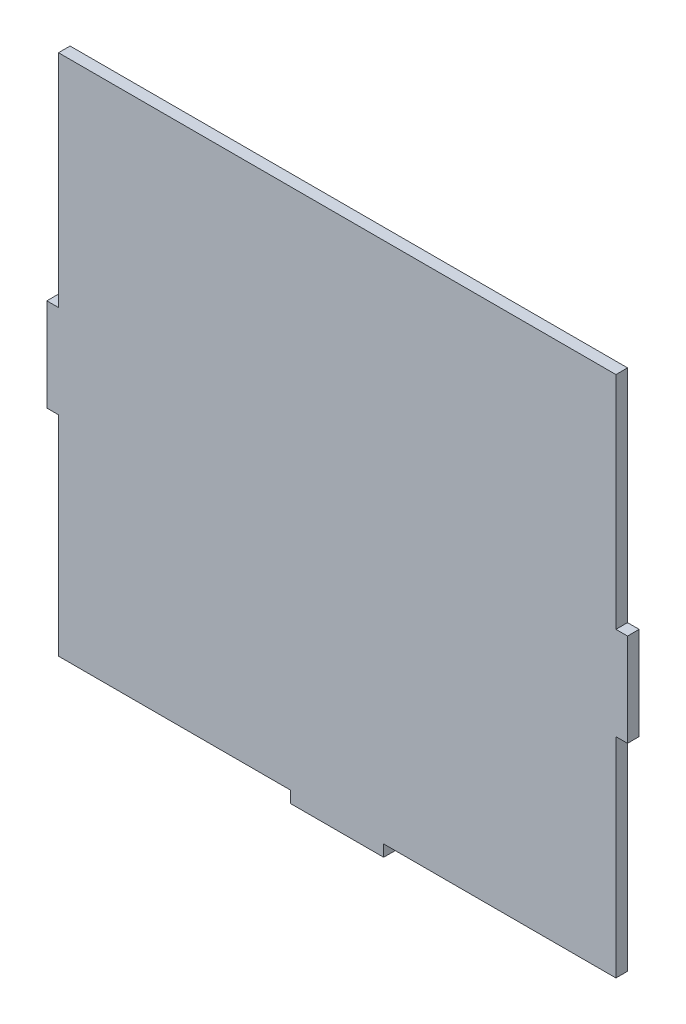
ISO-10303-21;
HEADER;
FILE_DESCRIPTION(('STEP AP214'),'2;1');
FILE_NAME('part.step','',(''),(''),'','','');
FILE_SCHEMA(('AUTOMOTIVE_DESIGN { 1 0 10303 214 1 1 1 1 }'));
ENDSEC;
DATA;
#1=APPLICATION_CONTEXT('core data for automotive mechanical design processes');
#2=APPLICATION_PROTOCOL_DEFINITION('international standard','automotive_design',2000,#1);
#3=PRODUCT_CONTEXT('',#1,'mechanical');
#4=PRODUCT('Part','Part','',(#3));
#5=PRODUCT_RELATED_PRODUCT_CATEGORY('part','',(#4));
#6=PRODUCT_DEFINITION_FORMATION('','',#4);
#7=PRODUCT_DEFINITION_CONTEXT('part definition',#1,'design');
#8=PRODUCT_DEFINITION('design','',#6,#7);
#9=PRODUCT_DEFINITION_SHAPE('','',#8);
#10=(LENGTH_UNIT() NAMED_UNIT(*) SI_UNIT(.MILLI.,.METRE.));
#11=(NAMED_UNIT(*) PLANE_ANGLE_UNIT() SI_UNIT($,.RADIAN.));
#12=(NAMED_UNIT(*) SI_UNIT($,.STERADIAN.) SOLID_ANGLE_UNIT());
#13=UNCERTAINTY_MEASURE_WITH_UNIT(LENGTH_MEASURE(1.E-05),#10,'distance_accuracy_value','');
#14=(GEOMETRIC_REPRESENTATION_CONTEXT(3) GLOBAL_UNCERTAINTY_ASSIGNED_CONTEXT((#13)) GLOBAL_UNIT_ASSIGNED_CONTEXT((#10,
#11,#12)) REPRESENTATION_CONTEXT('',''));
#15=CARTESIAN_POINT('',(0.,0.,0.));
#16=DIRECTION('',(0.,0.,1.));
#17=DIRECTION('',(1.,0.,0.));
#18=AXIS2_PLACEMENT_3D('',#15,#16,#17);
#19=CARTESIAN_POINT('',(5.,-316.519772215718,5.));
#20=DIRECTION('',(0.,1.,0.));
#21=DIRECTION('',(0.,0.,1.));
#22=AXIS2_PLACEMENT_3D('',#19,#20,#21);
#23=PLANE('',#22);
#24=DIRECTION('',(1.,0.,0.));
#25=VECTOR('',#24,1.);
#26=CARTESIAN_POINT('',(5.,-316.519772215718,0.));
#27=LINE('',#26,#25);
#28=CARTESIAN_POINT('',(5.,-316.519772215718,0.));
#29=VERTEX_POINT('',#28);
#30=CARTESIAN_POINT('',(105.,-316.519772215718,0.));
#31=VERTEX_POINT('',#30);
#32=EDGE_CURVE('E178',#29,#31,#27,.T.);
#33=ORIENTED_EDGE('',*,*,#32,.T.);
#34=DIRECTION('',(0.,0.,-1.));
#35=VECTOR('',#34,1.);
#36=CARTESIAN_POINT('',(105.,-316.519772215718,5.));
#37=LINE('',#36,#35);
#38=CARTESIAN_POINT('',(105.,-316.519772215718,5.));
#39=VERTEX_POINT('',#38);
#40=EDGE_CURVE('E11',#39,#31,#37,.T.);
#41=ORIENTED_EDGE('',*,*,#40,.F.);
#42=DIRECTION('',(1.,0.,0.));
#43=VECTOR('',#42,1.);
#44=CARTESIAN_POINT('',(5.,-316.519772215718,5.));
#45=LINE('',#44,#43);
#46=CARTESIAN_POINT('',(5.,-316.519772215718,5.));
#47=VERTEX_POINT('',#46);
#48=EDGE_CURVE('E208',#47,#39,#45,.T.);
#49=ORIENTED_EDGE('',*,*,#48,.F.);
#50=DIRECTION('',(0.,0.,-1.));
#51=VECTOR('',#50,1.);
#52=CARTESIAN_POINT('',(5.,-316.519772215718,5.));
#53=LINE('',#52,#51);
#54=EDGE_CURVE('E174',#47,#29,#53,.T.);
#55=ORIENTED_EDGE('',*,*,#54,.T.);
#56=EDGE_LOOP('',(#33,#41,#49,#55));
#57=FACE_BOUND('',#56,.T.);
#58=ADVANCED_FACE('F34',(#57),#23,.F.);
#59=CARTESIAN_POINT('',(105.,-316.519772215718,5.));
#60=DIRECTION('',(1.,0.,0.));
#61=DIRECTION('',(0.,0.,-1.));
#62=AXIS2_PLACEMENT_3D('',#59,#60,#61);
#63=PLANE('',#62);
#64=DIRECTION('',(0.,-1.,0.));
#65=VECTOR('',#64,1.);
#66=CARTESIAN_POINT('',(105.,-316.519772215718,0.));
#67=LINE('',#66,#65);
#68=CARTESIAN_POINT('',(105.,-321.519772215718,0.));
#69=VERTEX_POINT('',#68);
#70=EDGE_CURVE('E181',#31,#69,#67,.T.);
#71=ORIENTED_EDGE('',*,*,#70,.T.);
#72=DIRECTION('',(0.,0.,-1.));
#73=VECTOR('',#72,1.);
#74=CARTESIAN_POINT('',(105.,-321.519772215718,5.));
#75=LINE('',#74,#73);
#76=CARTESIAN_POINT('',(105.,-321.519772215718,5.));
#77=VERTEX_POINT('',#76);
#78=EDGE_CURVE('E42',#77,#69,#75,.T.);
#79=ORIENTED_EDGE('',*,*,#78,.F.);
#80=DIRECTION('',(0.,-1.,0.));
#81=VECTOR('',#80,1.);
#82=CARTESIAN_POINT('',(105.,-316.519772215718,5.));
#83=LINE('',#82,#81);
#84=EDGE_CURVE('E117',#39,#77,#83,.T.);
#85=ORIENTED_EDGE('',*,*,#84,.F.);
#86=ORIENTED_EDGE('',*,*,#40,.T.);
#87=EDGE_LOOP('',(#71,#79,#85,#86));
#88=FACE_BOUND('',#87,.T.);
#89=ADVANCED_FACE('F306',(#88),#63,.F.);
#90=CARTESIAN_POINT('',(105.,-321.519772215718,5.));
#91=DIRECTION('',(0.,1.,0.));
#92=DIRECTION('',(0.,0.,1.));
#93=AXIS2_PLACEMENT_3D('',#90,#91,#92);
#94=PLANE('',#93);
#95=DIRECTION('',(1.,0.,0.));
#96=VECTOR('',#95,1.);
#97=CARTESIAN_POINT('',(105.,-321.519772215718,0.));
#98=LINE('',#97,#96);
#99=CARTESIAN_POINT('',(145.,-321.519772215718,0.));
#100=VERTEX_POINT('',#99);
#101=EDGE_CURVE('E183',#69,#100,#98,.T.);
#102=ORIENTED_EDGE('',*,*,#101,.T.);
#103=DIRECTION('',(0.,0.,-1.));
#104=VECTOR('',#103,1.);
#105=CARTESIAN_POINT('',(145.,-321.519772215718,5.));
#106=LINE('',#105,#104);
#107=CARTESIAN_POINT('',(145.,-321.519772215718,5.));
#108=VERTEX_POINT('',#107);
#109=EDGE_CURVE('E239',#108,#100,#106,.T.);
#110=ORIENTED_EDGE('',*,*,#109,.F.);
#111=DIRECTION('',(1.,0.,0.));
#112=VECTOR('',#111,1.);
#113=CARTESIAN_POINT('',(105.,-321.519772215718,5.));
#114=LINE('',#113,#112);
#115=EDGE_CURVE('E247',#77,#108,#114,.T.);
#116=ORIENTED_EDGE('',*,*,#115,.F.);
#117=ORIENTED_EDGE('',*,*,#78,.T.);
#118=EDGE_LOOP('',(#102,#110,#116,#117));
#119=FACE_BOUND('',#118,.T.);
#120=ADVANCED_FACE('F245',(#119),#94,.F.);
#121=CARTESIAN_POINT('',(145.,-316.519772215718,5.));
#122=DIRECTION('',(-1.,0.,0.));
#123=DIRECTION('',(0.,0.,1.));
#124=AXIS2_PLACEMENT_3D('',#121,#122,#123);
#125=PLANE('',#124);
#126=DIRECTION('',(0.,1.,0.));
#127=VECTOR('',#126,1.);
#128=CARTESIAN_POINT('',(145.,-316.519772215718,0.));
#129=LINE('',#128,#127);
#130=CARTESIAN_POINT('',(145.,-316.519772215718,0.));
#131=VERTEX_POINT('',#130);
#132=EDGE_CURVE('E185',#100,#131,#129,.T.);
#133=ORIENTED_EDGE('',*,*,#132,.T.);
#134=DIRECTION('',(0.,0.,-1.));
#135=VECTOR('',#134,1.);
#136=CARTESIAN_POINT('',(145.,-316.519772215718,5.));
#137=LINE('',#136,#135);
#138=CARTESIAN_POINT('',(145.,-316.519772215718,5.));
#139=VERTEX_POINT('',#138);
#140=EDGE_CURVE('E236',#139,#131,#137,.T.);
#141=ORIENTED_EDGE('',*,*,#140,.F.);
#142=DIRECTION('',(0.,1.,0.));
#143=VECTOR('',#142,1.);
#144=CARTESIAN_POINT('',(145.,-316.519772215718,5.));
#145=LINE('',#144,#143);
#146=EDGE_CURVE('E265',#108,#139,#145,.T.);
#147=ORIENTED_EDGE('',*,*,#146,.F.);
#148=ORIENTED_EDGE('',*,*,#109,.T.);
#149=EDGE_LOOP('',(#133,#141,#147,#148));
#150=FACE_BOUND('',#149,.T.);
#151=ADVANCED_FACE('F256',(#150),#125,.F.);
#152=CARTESIAN_POINT('',(145.,-316.519772215718,5.));
#153=DIRECTION('',(0.,1.,0.));
#154=DIRECTION('',(0.,0.,1.));
#155=AXIS2_PLACEMENT_3D('',#152,#153,#154);
#156=PLANE('',#155);
#157=DIRECTION('',(1.,0.,0.));
#158=VECTOR('',#157,1.);
#159=CARTESIAN_POINT('',(145.,-316.519772215718,0.));
#160=LINE('',#159,#158);
#161=CARTESIAN_POINT('',(245.,-316.519772215718,0.));
#162=VERTEX_POINT('',#161);
#163=EDGE_CURVE('E187',#131,#162,#160,.T.);
#164=ORIENTED_EDGE('',*,*,#163,.T.);
#165=DIRECTION('',(0.,0.,-1.));
#166=VECTOR('',#165,1.);
#167=CARTESIAN_POINT('',(245.,-316.519772215718,5.));
#168=LINE('',#167,#166);
#169=CARTESIAN_POINT('',(245.,-316.519772215718,5.));
#170=VERTEX_POINT('',#169);
#171=EDGE_CURVE('E233',#170,#162,#168,.T.);
#172=ORIENTED_EDGE('',*,*,#171,.F.);
#173=DIRECTION('',(1.,0.,0.));
#174=VECTOR('',#173,1.);
#175=CARTESIAN_POINT('',(145.,-316.519772215718,5.));
#176=LINE('',#175,#174);
#177=EDGE_CURVE('E262',#139,#170,#176,.T.);
#178=ORIENTED_EDGE('',*,*,#177,.F.);
#179=ORIENTED_EDGE('',*,*,#140,.T.);
#180=EDGE_LOOP('',(#164,#172,#178,#179));
#181=FACE_BOUND('',#180,.T.);
#182=ADVANCED_FACE('F260',(#181),#156,.F.);
#183=CARTESIAN_POINT('',(245.,-226.519772215718,5.));
#184=DIRECTION('',(-1.,0.,0.));
#185=DIRECTION('',(0.,0.,1.));
#186=AXIS2_PLACEMENT_3D('',#183,#184,#185);
#187=PLANE('',#186);
#188=DIRECTION('',(0.,1.,0.));
#189=VECTOR('',#188,1.);
#190=CARTESIAN_POINT('',(245.,-226.519772215718,0.));
#191=LINE('',#190,#189);
#192=CARTESIAN_POINT('',(245.,-226.519772215718,0.));
#193=VERTEX_POINT('',#192);
#194=EDGE_CURVE('E189',#162,#193,#191,.T.);
#195=ORIENTED_EDGE('',*,*,#194,.T.);
#196=DIRECTION('',(0.,0.,-1.));
#197=VECTOR('',#196,1.);
#198=CARTESIAN_POINT('',(245.,-226.519772215718,5.));
#199=LINE('',#198,#197);
#200=CARTESIAN_POINT('',(245.,-226.519772215718,5.));
#201=VERTEX_POINT('',#200);
#202=EDGE_CURVE('E230',#201,#193,#199,.T.);
#203=ORIENTED_EDGE('',*,*,#202,.F.);
#204=DIRECTION('',(0.,1.,0.));
#205=VECTOR('',#204,1.);
#206=CARTESIAN_POINT('',(245.,-226.519772215718,5.));
#207=LINE('',#206,#205);
#208=EDGE_CURVE('E264',#170,#201,#207,.T.);
#209=ORIENTED_EDGE('',*,*,#208,.F.);
#210=ORIENTED_EDGE('',*,*,#171,.T.);
#211=EDGE_LOOP('',(#195,#203,#209,#210));
#212=FACE_BOUND('',#211,.T.);
#213=ADVANCED_FACE('F319',(#212),#187,.F.);
#214=CARTESIAN_POINT('',(250.,-226.519772215718,5.));
#215=DIRECTION('',(0.,1.,0.));
#216=DIRECTION('',(0.,0.,1.));
#217=AXIS2_PLACEMENT_3D('',#214,#215,#216);
#218=PLANE('',#217);
#219=DIRECTION('',(1.,0.,0.));
#220=VECTOR('',#219,1.);
#221=CARTESIAN_POINT('',(250.,-226.519772215718,0.));
#222=LINE('',#221,#220);
#223=CARTESIAN_POINT('',(250.,-226.519772215718,0.));
#224=VERTEX_POINT('',#223);
#225=EDGE_CURVE('E191',#193,#224,#222,.T.);
#226=ORIENTED_EDGE('',*,*,#225,.T.);
#227=DIRECTION('',(0.,0.,-1.));
#228=VECTOR('',#227,1.);
#229=CARTESIAN_POINT('',(250.,-226.519772215718,5.));
#230=LINE('',#229,#228);
#231=CARTESIAN_POINT('',(250.,-226.519772215718,5.));
#232=VERTEX_POINT('',#231);
#233=EDGE_CURVE('E227',#232,#224,#230,.T.);
#234=ORIENTED_EDGE('',*,*,#233,.F.);
#235=DIRECTION('',(1.,0.,0.));
#236=VECTOR('',#235,1.);
#237=CARTESIAN_POINT('',(250.,-226.519772215718,5.));
#238=LINE('',#237,#236);
#239=EDGE_CURVE('E267',#201,#232,#238,.T.);
#240=ORIENTED_EDGE('',*,*,#239,.F.);
#241=ORIENTED_EDGE('',*,*,#202,.T.);
#242=EDGE_LOOP('',(#226,#234,#240,#241));
#243=FACE_BOUND('',#242,.T.);
#244=ADVANCED_FACE('F322',(#243),#218,.F.);
#245=CARTESIAN_POINT('',(250.,-186.519772215718,5.));
#246=DIRECTION('',(-1.,0.,0.));
#247=DIRECTION('',(0.,0.,1.));
#248=AXIS2_PLACEMENT_3D('',#245,#246,#247);
#249=PLANE('',#248);
#250=DIRECTION('',(0.,1.,0.));
#251=VECTOR('',#250,1.);
#252=CARTESIAN_POINT('',(250.,-186.519772215718,0.));
#253=LINE('',#252,#251);
#254=CARTESIAN_POINT('',(250.,-186.519772215718,0.));
#255=VERTEX_POINT('',#254);
#256=EDGE_CURVE('E193',#224,#255,#253,.T.);
#257=ORIENTED_EDGE('',*,*,#256,.T.);
#258=DIRECTION('',(0.,0.,-1.));
#259=VECTOR('',#258,1.);
#260=CARTESIAN_POINT('',(250.,-186.519772215718,5.));
#261=LINE('',#260,#259);
#262=CARTESIAN_POINT('',(250.,-186.519772215718,5.));
#263=VERTEX_POINT('',#262);
#264=EDGE_CURVE('E224',#263,#255,#261,.T.);
#265=ORIENTED_EDGE('',*,*,#264,.F.);
#266=DIRECTION('',(0.,1.,0.));
#267=VECTOR('',#266,1.);
#268=CARTESIAN_POINT('',(250.,-186.519772215718,5.));
#269=LINE('',#268,#267);
#270=EDGE_CURVE('E273',#232,#263,#269,.T.);
#271=ORIENTED_EDGE('',*,*,#270,.F.);
#272=ORIENTED_EDGE('',*,*,#233,.T.);
#273=EDGE_LOOP('',(#257,#265,#271,#272));
#274=FACE_BOUND('',#273,.T.);
#275=ADVANCED_FACE('F326',(#274),#249,.F.);
#276=CARTESIAN_POINT('',(245.,-186.519772215718,5.));
#277=DIRECTION('',(0.,-1.,0.));
#278=DIRECTION('',(0.,0.,-1.));
#279=AXIS2_PLACEMENT_3D('',#276,#277,#278);
#280=PLANE('',#279);
#281=DIRECTION('',(-1.,0.,0.));
#282=VECTOR('',#281,1.);
#283=CARTESIAN_POINT('',(245.,-186.519772215718,0.));
#284=LINE('',#283,#282);
#285=CARTESIAN_POINT('',(245.,-186.519772215718,0.));
#286=VERTEX_POINT('',#285);
#287=EDGE_CURVE('E195',#255,#286,#284,.T.);
#288=ORIENTED_EDGE('',*,*,#287,.T.);
#289=DIRECTION('',(0.,0.,-1.));
#290=VECTOR('',#289,1.);
#291=CARTESIAN_POINT('',(245.,-186.519772215718,5.));
#292=LINE('',#291,#290);
#293=CARTESIAN_POINT('',(245.,-186.519772215718,5.));
#294=VERTEX_POINT('',#293);
#295=EDGE_CURVE('E221',#294,#286,#292,.T.);
#296=ORIENTED_EDGE('',*,*,#295,.F.);
#297=DIRECTION('',(-1.,0.,0.));
#298=VECTOR('',#297,1.);
#299=CARTESIAN_POINT('',(245.,-186.519772215718,5.));
#300=LINE('',#299,#298);
#301=EDGE_CURVE('E275',#263,#294,#300,.T.);
#302=ORIENTED_EDGE('',*,*,#301,.F.);
#303=ORIENTED_EDGE('',*,*,#264,.T.);
#304=EDGE_LOOP('',(#288,#296,#302,#303));
#305=FACE_BOUND('',#304,.T.);
#306=ADVANCED_FACE('F330',(#305),#280,.F.);
#307=CARTESIAN_POINT('',(245.,-91.5197722157181,5.));
#308=DIRECTION('',(-1.,0.,0.));
#309=DIRECTION('',(0.,0.,1.));
#310=AXIS2_PLACEMENT_3D('',#307,#308,#309);
#311=PLANE('',#310);
#312=DIRECTION('',(0.,1.,0.));
#313=VECTOR('',#312,1.);
#314=CARTESIAN_POINT('',(245.,-91.5197722157181,0.));
#315=LINE('',#314,#313);
#316=CARTESIAN_POINT('',(245.,-91.5197722157181,0.));
#317=VERTEX_POINT('',#316);
#318=EDGE_CURVE('E197',#286,#317,#315,.T.);
#319=ORIENTED_EDGE('',*,*,#318,.T.);
#320=DIRECTION('',(0.,0.,-1.));
#321=VECTOR('',#320,1.);
#322=CARTESIAN_POINT('',(245.,-91.5197722157181,5.));
#323=LINE('',#322,#321);
#324=CARTESIAN_POINT('',(245.,-91.5197722157181,5.));
#325=VERTEX_POINT('',#324);
#326=EDGE_CURVE('E218',#325,#317,#323,.T.);
#327=ORIENTED_EDGE('',*,*,#326,.F.);
#328=DIRECTION('',(0.,1.,0.));
#329=VECTOR('',#328,1.);
#330=CARTESIAN_POINT('',(245.,-91.5197722157181,5.));
#331=LINE('',#330,#329);
#332=EDGE_CURVE('E277',#294,#325,#331,.T.);
#333=ORIENTED_EDGE('',*,*,#332,.F.);
#334=ORIENTED_EDGE('',*,*,#295,.T.);
#335=EDGE_LOOP('',(#319,#327,#333,#334));
#336=FACE_BOUND('',#335,.T.);
#337=ADVANCED_FACE('F334',(#336),#311,.F.);
#338=CARTESIAN_POINT('',(5.,-91.5197722157181,5.));
#339=DIRECTION('',(0.,-1.,0.));
#340=DIRECTION('',(0.,0.,-1.));
#341=AXIS2_PLACEMENT_3D('',#338,#339,#340);
#342=PLANE('',#341);
#343=DIRECTION('',(-1.,0.,0.));
#344=VECTOR('',#343,1.);
#345=CARTESIAN_POINT('',(5.,-91.5197722157181,0.));
#346=LINE('',#345,#344);
#347=CARTESIAN_POINT('',(5.,-91.5197722157181,0.));
#348=VERTEX_POINT('',#347);
#349=EDGE_CURVE('E199',#317,#348,#346,.T.);
#350=ORIENTED_EDGE('',*,*,#349,.T.);
#351=DIRECTION('',(0.,0.,-1.));
#352=VECTOR('',#351,1.);
#353=CARTESIAN_POINT('',(5.,-91.5197722157181,5.));
#354=LINE('',#353,#352);
#355=CARTESIAN_POINT('',(5.,-91.5197722157181,5.));
#356=VERTEX_POINT('',#355);
#357=EDGE_CURVE('E215',#356,#348,#354,.T.);
#358=ORIENTED_EDGE('',*,*,#357,.F.);
#359=DIRECTION('',(-1.,0.,0.));
#360=VECTOR('',#359,1.);
#361=CARTESIAN_POINT('',(5.,-91.5197722157181,5.));
#362=LINE('',#361,#360);
#363=EDGE_CURVE('E279',#325,#356,#362,.T.);
#364=ORIENTED_EDGE('',*,*,#363,.F.);
#365=ORIENTED_EDGE('',*,*,#326,.T.);
#366=EDGE_LOOP('',(#350,#358,#364,#365));
#367=FACE_BOUND('',#366,.T.);
#368=ADVANCED_FACE('F338',(#367),#342,.F.);
#369=CARTESIAN_POINT('',(5.,-91.5197722157181,5.));
#370=DIRECTION('',(1.,0.,0.));
#371=DIRECTION('',(0.,0.,-1.));
#372=AXIS2_PLACEMENT_3D('',#369,#370,#371);
#373=PLANE('',#372);
#374=DIRECTION('',(0.,-1.,0.));
#375=VECTOR('',#374,1.);
#376=CARTESIAN_POINT('',(5.,-91.5197722157181,0.));
#377=LINE('',#376,#375);
#378=CARTESIAN_POINT('',(5.,-186.519772215718,0.));
#379=VERTEX_POINT('',#378);
#380=EDGE_CURVE('E201',#348,#379,#377,.T.);
#381=ORIENTED_EDGE('',*,*,#380,.T.);
#382=DIRECTION('',(0.,0.,-1.));
#383=VECTOR('',#382,1.);
#384=CARTESIAN_POINT('',(5.,-186.519772215718,5.));
#385=LINE('',#384,#383);
#386=CARTESIAN_POINT('',(5.,-186.519772215718,5.));
#387=VERTEX_POINT('',#386);
#388=EDGE_CURVE('E212',#387,#379,#385,.T.);
#389=ORIENTED_EDGE('',*,*,#388,.F.);
#390=DIRECTION('',(0.,-1.,0.));
#391=VECTOR('',#390,1.);
#392=CARTESIAN_POINT('',(5.,-91.5197722157181,5.));
#393=LINE('',#392,#391);
#394=EDGE_CURVE('E281',#356,#387,#393,.T.);
#395=ORIENTED_EDGE('',*,*,#394,.F.);
#396=ORIENTED_EDGE('',*,*,#357,.T.);
#397=EDGE_LOOP('',(#381,#389,#395,#396));
#398=FACE_BOUND('',#397,.T.);
#399=ADVANCED_FACE('F287',(#398),#373,.F.);
#400=CARTESIAN_POINT('',(5.,-186.519772215718,5.));
#401=DIRECTION('',(0.,-1.,0.));
#402=DIRECTION('',(0.,0.,-1.));
#403=AXIS2_PLACEMENT_3D('',#400,#401,#402);
#404=PLANE('',#403);
#405=DIRECTION('',(-1.,0.,0.));
#406=VECTOR('',#405,1.);
#407=CARTESIAN_POINT('',(5.,-186.519772215718,0.));
#408=LINE('',#407,#406);
#409=CARTESIAN_POINT('',(0.,-186.519772215718,0.));
#410=VERTEX_POINT('',#409);
#411=EDGE_CURVE('E203',#379,#410,#408,.T.);
#412=ORIENTED_EDGE('',*,*,#411,.T.);
#413=DIRECTION('',(0.,0.,-1.));
#414=VECTOR('',#413,1.);
#415=CARTESIAN_POINT('',(0.,-186.519772215718,5.));
#416=LINE('',#415,#414);
#417=CARTESIAN_POINT('',(0.,-186.519772215718,5.));
#418=VERTEX_POINT('',#417);
#419=EDGE_CURVE('E169',#418,#410,#416,.T.);
#420=ORIENTED_EDGE('',*,*,#419,.F.);
#421=DIRECTION('',(-1.,0.,0.));
#422=VECTOR('',#421,1.);
#423=CARTESIAN_POINT('',(5.,-186.519772215718,5.));
#424=LINE('',#423,#422);
#425=EDGE_CURVE('E160',#387,#418,#424,.T.);
#426=ORIENTED_EDGE('',*,*,#425,.F.);
#427=ORIENTED_EDGE('',*,*,#388,.T.);
#428=EDGE_LOOP('',(#412,#420,#426,#427));
#429=FACE_BOUND('',#428,.T.);
#430=ADVANCED_FACE('F291',(#429),#404,.F.);
#431=CARTESIAN_POINT('',(0.,-186.519772215718,5.));
#432=DIRECTION('',(1.,0.,0.));
#433=DIRECTION('',(0.,0.,-1.));
#434=AXIS2_PLACEMENT_3D('',#431,#432,#433);
#435=PLANE('',#434);
#436=DIRECTION('',(0.,-1.,0.));
#437=VECTOR('',#436,1.);
#438=CARTESIAN_POINT('',(0.,-186.519772215718,0.));
#439=LINE('',#438,#437);
#440=CARTESIAN_POINT('',(0.,-226.519772215718,0.));
#441=VERTEX_POINT('',#440);
#442=EDGE_CURVE('E168',#410,#441,#439,.T.);
#443=ORIENTED_EDGE('',*,*,#442,.T.);
#444=DIRECTION('',(0.,0.,-1.));
#445=VECTOR('',#444,1.);
#446=CARTESIAN_POINT('',(0.,-226.519772215718,5.));
#447=LINE('',#446,#445);
#448=CARTESIAN_POINT('',(0.,-226.519772215718,5.));
#449=VERTEX_POINT('',#448);
#450=EDGE_CURVE('E165',#449,#441,#447,.T.);
#451=ORIENTED_EDGE('',*,*,#450,.F.);
#452=DIRECTION('',(0.,-1.,0.));
#453=VECTOR('',#452,1.);
#454=CARTESIAN_POINT('',(0.,-186.519772215718,5.));
#455=LINE('',#454,#453);
#456=EDGE_CURVE('E154',#418,#449,#455,.T.);
#457=ORIENTED_EDGE('',*,*,#456,.F.);
#458=ORIENTED_EDGE('',*,*,#419,.T.);
#459=EDGE_LOOP('',(#443,#451,#457,#458));
#460=FACE_BOUND('',#459,.T.);
#461=ADVANCED_FACE('F166',(#460),#435,.F.);
#462=CARTESIAN_POINT('',(0.,-226.519772215718,5.));
#463=DIRECTION('',(0.,1.,0.));
#464=DIRECTION('',(0.,0.,1.));
#465=AXIS2_PLACEMENT_3D('',#462,#463,#464);
#466=PLANE('',#465);
#467=DIRECTION('',(1.,0.,0.));
#468=VECTOR('',#467,1.);
#469=CARTESIAN_POINT('',(0.,-226.519772215718,0.));
#470=LINE('',#469,#468);
#471=CARTESIAN_POINT('',(5.,-226.519772215718,0.));
#472=VERTEX_POINT('',#471);
#473=EDGE_CURVE('E103',#441,#472,#470,.T.);
#474=ORIENTED_EDGE('',*,*,#473,.T.);
#475=DIRECTION('',(0.,0.,-1.));
#476=VECTOR('',#475,1.);
#477=CARTESIAN_POINT('',(5.,-226.519772215718,5.));
#478=LINE('',#477,#476);
#479=CARTESIAN_POINT('',(5.,-226.519772215718,5.));
#480=VERTEX_POINT('',#479);
#481=EDGE_CURVE('E170',#480,#472,#478,.T.);
#482=ORIENTED_EDGE('',*,*,#481,.F.);
#483=DIRECTION('',(1.,0.,0.));
#484=VECTOR('',#483,1.);
#485=CARTESIAN_POINT('',(0.,-226.519772215718,5.));
#486=LINE('',#485,#484);
#487=EDGE_CURVE('E158',#449,#480,#486,.T.);
#488=ORIENTED_EDGE('',*,*,#487,.F.);
#489=ORIENTED_EDGE('',*,*,#450,.T.);
#490=EDGE_LOOP('',(#474,#482,#488,#489));
#491=FACE_BOUND('',#490,.T.);
#492=ADVANCED_FACE('F172',(#491),#466,.F.);
#493=CARTESIAN_POINT('',(5.,-226.519772215718,5.));
#494=DIRECTION('',(1.,0.,0.));
#495=DIRECTION('',(0.,0.,-1.));
#496=AXIS2_PLACEMENT_3D('',#493,#494,#495);
#497=PLANE('',#496);
#498=DIRECTION('',(0.,-1.,0.));
#499=VECTOR('',#498,1.);
#500=CARTESIAN_POINT('',(5.,-226.519772215718,0.));
#501=LINE('',#500,#499);
#502=EDGE_CURVE('E109',#472,#29,#501,.T.);
#503=ORIENTED_EDGE('',*,*,#502,.T.);
#504=ORIENTED_EDGE('',*,*,#54,.F.);
#505=DIRECTION('',(0.,-1.,0.));
#506=VECTOR('',#505,1.);
#507=CARTESIAN_POINT('',(5.,-226.519772215718,5.));
#508=LINE('',#507,#506);
#509=EDGE_CURVE('E50',#480,#47,#508,.T.);
#510=ORIENTED_EDGE('',*,*,#509,.F.);
#511=ORIENTED_EDGE('',*,*,#481,.T.);
#512=EDGE_LOOP('',(#503,#504,#510,#511));
#513=FACE_BOUND('',#512,.T.);
#514=ADVANCED_FACE('F295',(#513),#497,.F.);
#515=CARTESIAN_POINT('',(0.,0.,5.));
#516=DIRECTION('',(0.,0.,-1.));
#517=DIRECTION('',(-1.,0.,0.));
#518=AXIS2_PLACEMENT_3D('',#515,#516,#517);
#519=PLANE('',#518);
#520=ORIENTED_EDGE('',*,*,#48,.T.);
#521=ORIENTED_EDGE('',*,*,#84,.T.);
#522=ORIENTED_EDGE('',*,*,#115,.T.);
#523=ORIENTED_EDGE('',*,*,#146,.T.);
#524=ORIENTED_EDGE('',*,*,#177,.T.);
#525=ORIENTED_EDGE('',*,*,#208,.T.);
#526=ORIENTED_EDGE('',*,*,#239,.T.);
#527=ORIENTED_EDGE('',*,*,#270,.T.);
#528=ORIENTED_EDGE('',*,*,#301,.T.);
#529=ORIENTED_EDGE('',*,*,#332,.T.);
#530=ORIENTED_EDGE('',*,*,#363,.T.);
#531=ORIENTED_EDGE('',*,*,#394,.T.);
#532=ORIENTED_EDGE('',*,*,#425,.T.);
#533=ORIENTED_EDGE('',*,*,#456,.T.);
#534=ORIENTED_EDGE('',*,*,#487,.T.);
#535=ORIENTED_EDGE('',*,*,#509,.T.);
#536=EDGE_LOOP('',(#520,#521,#522,#523,#524,#525,#526,#527,#528,#529,#530,#531,#532,#533,#534,#535));
#537=FACE_BOUND('',#536,.T.);
#538=ADVANCED_FACE('F156',(#537),#519,.F.);
#539=CARTESIAN_POINT('',(0.,0.,0.));
#540=DIRECTION('',(0.,0.,-1.));
#541=DIRECTION('',(-1.,0.,0.));
#542=AXIS2_PLACEMENT_3D('',#539,#540,#541);
#543=PLANE('',#542);
#544=ORIENTED_EDGE('',*,*,#32,.F.);
#545=ORIENTED_EDGE('',*,*,#502,.F.);
#546=ORIENTED_EDGE('',*,*,#473,.F.);
#547=ORIENTED_EDGE('',*,*,#442,.F.);
#548=ORIENTED_EDGE('',*,*,#411,.F.);
#549=ORIENTED_EDGE('',*,*,#380,.F.);
#550=ORIENTED_EDGE('',*,*,#349,.F.);
#551=ORIENTED_EDGE('',*,*,#318,.F.);
#552=ORIENTED_EDGE('',*,*,#287,.F.);
#553=ORIENTED_EDGE('',*,*,#256,.F.);
#554=ORIENTED_EDGE('',*,*,#225,.F.);
#555=ORIENTED_EDGE('',*,*,#194,.F.);
#556=ORIENTED_EDGE('',*,*,#163,.F.);
#557=ORIENTED_EDGE('',*,*,#132,.F.);
#558=ORIENTED_EDGE('',*,*,#101,.F.);
#559=ORIENTED_EDGE('',*,*,#70,.F.);
#560=EDGE_LOOP('',(#544,#545,#546,#547,#548,#549,#550,#551,#552,#553,#554,#555,#556,#557,#558,#559));
#561=FACE_BOUND('',#560,.T.);
#562=ADVANCED_FACE('F251',(#561),#543,.T.);
#563=CLOSED_SHELL('',(#58,#89,#120,#151,#182,#213,#244,#275,#306,#337,#368,#399,#430,#461,#492,
#514,#538,#562));
#564=MANIFOLD_SOLID_BREP('B2',#563);
#565=ADVANCED_BREP_SHAPE_REPRESENTATION('',(#18,#564),#14);
#566=SHAPE_DEFINITION_REPRESENTATION(#9,#565);
ENDSEC;
END-ISO-10303-21;
